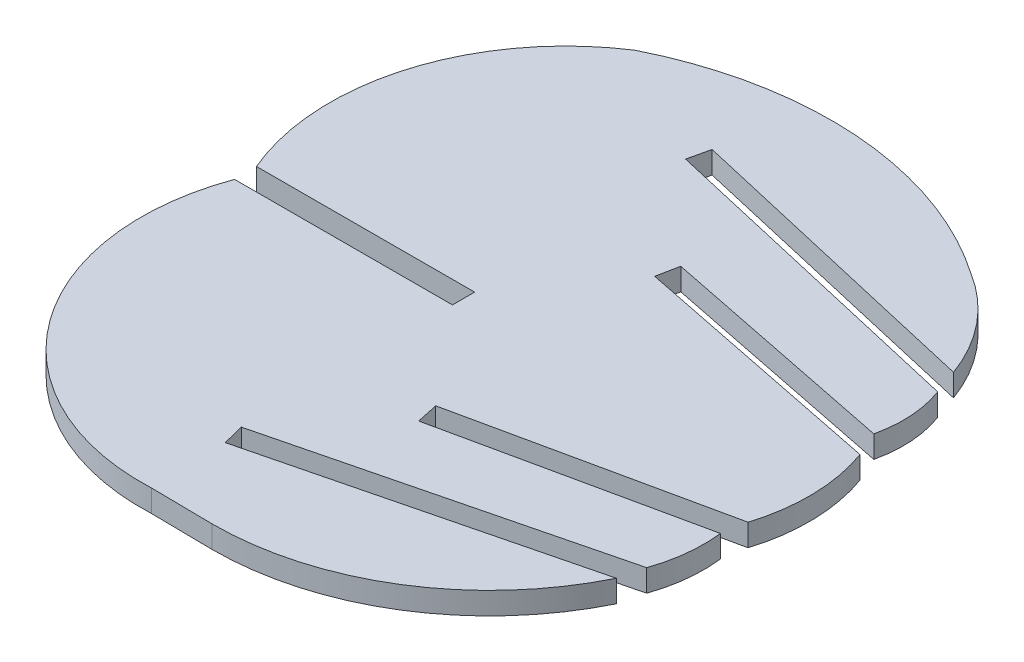
ISO-10303-21;
HEADER;
FILE_DESCRIPTION(('STEP AP214'),'2;1');
FILE_NAME('part.step','',(''),(''),'','','');
FILE_SCHEMA(('AUTOMOTIVE_DESIGN { 1 0 10303 214 1 1 1 1 }'));
ENDSEC;
DATA;
#1=APPLICATION_CONTEXT('core data for automotive mechanical design processes');
#2=APPLICATION_PROTOCOL_DEFINITION('international standard','automotive_design',2000,#1);
#3=PRODUCT_CONTEXT('',#1,'mechanical');
#4=PRODUCT('Part','Part','',(#3));
#5=PRODUCT_RELATED_PRODUCT_CATEGORY('part','',(#4));
#6=PRODUCT_DEFINITION_FORMATION('','',#4);
#7=PRODUCT_DEFINITION_CONTEXT('part definition',#1,'design');
#8=PRODUCT_DEFINITION('design','',#6,#7);
#9=PRODUCT_DEFINITION_SHAPE('','',#8);
#10=(LENGTH_UNIT() NAMED_UNIT(*) SI_UNIT(.MILLI.,.METRE.));
#11=(NAMED_UNIT(*) PLANE_ANGLE_UNIT() SI_UNIT($,.RADIAN.));
#12=(NAMED_UNIT(*) SI_UNIT($,.STERADIAN.) SOLID_ANGLE_UNIT());
#13=UNCERTAINTY_MEASURE_WITH_UNIT(LENGTH_MEASURE(1.E-05),#10,'distance_accuracy_value','');
#14=(GEOMETRIC_REPRESENTATION_CONTEXT(3) GLOBAL_UNCERTAINTY_ASSIGNED_CONTEXT((#13)) GLOBAL_UNIT_ASSIGNED_CONTEXT((#10,
#11,#12)) REPRESENTATION_CONTEXT('',''));
#15=CARTESIAN_POINT('',(0.,0.,0.));
#16=DIRECTION('',(0.,0.,1.));
#17=DIRECTION('',(1.,0.,0.));
#18=AXIS2_PLACEMENT_3D('',#15,#16,#17);
#19=CARTESIAN_POINT('',(-308.132334578698,2.,-455.012990323101));
#20=DIRECTION('',(0.,-1.,0.));
#21=DIRECTION('',(0.,0.,-1.));
#22=AXIS2_PLACEMENT_3D('',#19,#20,#21);
#23=CYLINDRICAL_SURFACE('',#22,32.1187501884);
#24=CARTESIAN_POINT('',(-308.132334578698,0.,-455.012990323101));
#25=DIRECTION('',(0.,1.,0.));
#26=DIRECTION('',(0.,0.,1.));
#27=AXIS2_PLACEMENT_3D('',#24,#25,#26);
#28=CIRCLE('',#27,32.1187501884);
#29=CARTESIAN_POINT('',(-289.859680000044,0.,-481.427460000042));
#30=VERTEX_POINT('',#29);
#31=CARTESIAN_POINT('',(-322.514210000017,0.,-483.731900000011));
#32=VERTEX_POINT('',#31);
#33=EDGE_CURVE('E229',#30,#32,#28,.T.);
#34=ORIENTED_EDGE('',*,*,#33,.T.);
#35=DIRECTION('',(0.,-1.,0.));
#36=VECTOR('',#35,1.);
#37=CARTESIAN_POINT('',(-322.514210000017,2.,-483.731900000011));
#38=LINE('',#37,#36);
#39=CARTESIAN_POINT('',(-322.514210000017,2.,-483.731900000011));
#40=VERTEX_POINT('',#39);
#41=EDGE_CURVE('E11',#40,#32,#38,.T.);
#42=ORIENTED_EDGE('',*,*,#41,.F.);
#43=CARTESIAN_POINT('',(-308.132334578698,2.,-455.012990323101));
#44=DIRECTION('',(0.,1.,0.));
#45=DIRECTION('',(0.,0.,1.));
#46=AXIS2_PLACEMENT_3D('',#43,#44,#45);
#47=CIRCLE('',#46,32.1187501884);
#48=CARTESIAN_POINT('',(-289.859680000044,2.,-481.427460000042));
#49=VERTEX_POINT('',#48);
#50=EDGE_CURVE('E275',#49,#40,#47,.T.);
#51=ORIENTED_EDGE('',*,*,#50,.F.);
#52=DIRECTION('',(0.,-1.,0.));
#53=VECTOR('',#52,1.);
#54=CARTESIAN_POINT('',(-289.859680000044,2.,-481.427460000042));
#55=LINE('',#54,#53);
#56=EDGE_CURVE('E225',#49,#30,#55,.T.);
#57=ORIENTED_EDGE('',*,*,#56,.T.);
#58=EDGE_LOOP('',(#34,#42,#51,#57));
#59=FACE_BOUND('',#58,.T.);
#60=ADVANCED_FACE('F37',(#59),#23,.T.);
#61=CARTESIAN_POINT('',(-310.896038219892,2.,-465.894165835681));
#62=DIRECTION('',(0.,-1.,0.));
#63=DIRECTION('',(0.,0.,-1.));
#64=AXIS2_PLACEMENT_3D('',#61,#62,#63);
#65=CYLINDRICAL_SURFACE('',#64,21.2877118458);
#66=CARTESIAN_POINT('',(-310.896038219892,0.,-465.894165835681));
#67=DIRECTION('',(0.,1.,0.));
#68=DIRECTION('',(0.,0.,1.));
#69=AXIS2_PLACEMENT_3D('',#66,#67,#68);
#70=CIRCLE('',#69,21.2877118458);
#71=CARTESIAN_POINT('',(-330.492059999991,0.,-457.577760000003));
#72=VERTEX_POINT('',#71);
#73=EDGE_CURVE('E232',#32,#72,#70,.T.);
#74=ORIENTED_EDGE('',*,*,#73,.T.);
#75=DIRECTION('',(0.,-1.,0.));
#76=VECTOR('',#75,1.);
#77=CARTESIAN_POINT('',(-330.492059999991,2.,-457.577760000003));
#78=LINE('',#77,#76);
#79=CARTESIAN_POINT('',(-330.492059999991,2.,-457.577760000003));
#80=VERTEX_POINT('',#79);
#81=EDGE_CURVE('E45',#80,#72,#78,.T.);
#82=ORIENTED_EDGE('',*,*,#81,.F.);
#83=CARTESIAN_POINT('',(-310.896038219892,2.,-465.894165835681));
#84=DIRECTION('',(0.,1.,0.));
#85=DIRECTION('',(0.,0.,1.));
#86=AXIS2_PLACEMENT_3D('',#83,#84,#85);
#87=CIRCLE('',#86,21.2877118458);
#88=EDGE_CURVE('E144',#40,#80,#87,.T.);
#89=ORIENTED_EDGE('',*,*,#88,.F.);
#90=ORIENTED_EDGE('',*,*,#41,.T.);
#91=EDGE_LOOP('',(#74,#82,#89,#90));
#92=FACE_BOUND('',#91,.T.);
#93=ADVANCED_FACE('F413',(#92),#65,.T.);
#94=CARTESIAN_POINT('',(-525.732548640906,2.,-457.344503106221));
#95=DIRECTION('',(-0.0011947149330365,0.,-0.99999928632786));
#96=DIRECTION('',(-0.99999928632786,0.,0.0011947149330365));
#97=AXIS2_PLACEMENT_3D('',#94,#95,#96);
#98=PLANE('',#97);
#99=DIRECTION('',(0.99999928632786,0.,-0.0011947149330365));
#100=VECTOR('',#99,1.);
#101=CARTESIAN_POINT('',(-525.732548640906,0.,-457.344503106221));
#102=LINE('',#101,#100);
#103=CARTESIAN_POINT('',(-310.83048,0.,-457.60125));
#104=VERTEX_POINT('',#103);
#105=EDGE_CURVE('E234',#72,#104,#102,.T.);
#106=ORIENTED_EDGE('',*,*,#105,.T.);
#107=DIRECTION('',(0.,-1.,0.));
#108=VECTOR('',#107,1.);
#109=CARTESIAN_POINT('',(-310.83048,2.,-457.60125));
#110=LINE('',#109,#108);
#111=CARTESIAN_POINT('',(-310.83048,2.,-457.60125));
#112=VERTEX_POINT('',#111);
#113=EDGE_CURVE('E330',#112,#104,#110,.T.);
#114=ORIENTED_EDGE('',*,*,#113,.F.);
#115=DIRECTION('',(0.99999928632786,0.,-0.0011947149330365));
#116=VECTOR('',#115,1.);
#117=CARTESIAN_POINT('',(-525.732548640906,2.,-457.344503106221));
#118=LINE('',#117,#116);
#119=EDGE_CURVE('E338',#80,#112,#118,.T.);
#120=ORIENTED_EDGE('',*,*,#119,.F.);
#121=ORIENTED_EDGE('',*,*,#81,.T.);
#122=EDGE_LOOP('',(#106,#114,#120,#121));
#123=FACE_BOUND('',#122,.T.);
#124=ADVANCED_FACE('F336',(#123),#98,.F.);
#125=CARTESIAN_POINT('',(-310.967666188731,2.,-572.401407932951));
#126=DIRECTION('',(0.999999285988265,0.,-0.00119499914676536));
#127=DIRECTION('',(-0.00119499914676536,0.,-0.999999285988265));
#128=AXIS2_PLACEMENT_3D('',#125,#126,#127);
#129=PLANE('',#128);
#130=DIRECTION('',(0.00119499914676536,0.,0.999999285988265));
#131=VECTOR('',#130,1.);
#132=CARTESIAN_POINT('',(-310.967666188731,0.,-572.401407932951));
#133=LINE('',#132,#131);
#134=CARTESIAN_POINT('',(-310.82809,0.,-455.60125));
#135=VERTEX_POINT('',#134);
#136=EDGE_CURVE('E236',#104,#135,#133,.T.);
#137=ORIENTED_EDGE('',*,*,#136,.T.);
#138=DIRECTION('',(0.,-1.,0.));
#139=VECTOR('',#138,1.);
#140=CARTESIAN_POINT('',(-310.82809,2.,-455.60125));
#141=LINE('',#140,#139);
#142=CARTESIAN_POINT('',(-310.82809,2.,-455.60125));
#143=VERTEX_POINT('',#142);
#144=EDGE_CURVE('E327',#143,#135,#141,.T.);
#145=ORIENTED_EDGE('',*,*,#144,.F.);
#146=DIRECTION('',(0.00119499914676536,0.,0.999999285988265));
#147=VECTOR('',#146,1.);
#148=CARTESIAN_POINT('',(-310.967666188731,2.,-572.401407932951));
#149=LINE('',#148,#147);
#150=EDGE_CURVE('E356',#112,#143,#149,.T.);
#151=ORIENTED_EDGE('',*,*,#150,.F.);
#152=ORIENTED_EDGE('',*,*,#113,.T.);
#153=EDGE_LOOP('',(#137,#145,#151,#152));
#154=FACE_BOUND('',#153,.T.);
#155=ADVANCED_FACE('F347',(#154),#129,.F.);
#156=CARTESIAN_POINT('',(-525.730151380826,2.,-455.344488742693));
#157=DIRECTION('',(0.00119478181080637,0.,0.999999286247958));
#158=DIRECTION('',(0.999999286247958,0.,-0.00119478181080637));
#159=AXIS2_PLACEMENT_3D('',#156,#157,#158);
#160=PLANE('',#159);
#161=DIRECTION('',(-0.999999286247958,0.,0.00119478181080637));
#162=VECTOR('',#161,1.);
#163=CARTESIAN_POINT('',(-525.730151380826,0.,-455.344488742693));
#164=LINE('',#163,#162);
#165=CARTESIAN_POINT('',(-330.47183,0.,-455.57778));
#166=VERTEX_POINT('',#165);
#167=EDGE_CURVE('E238',#135,#166,#164,.T.);
#168=ORIENTED_EDGE('',*,*,#167,.T.);
#169=DIRECTION('',(0.,-1.,0.));
#170=VECTOR('',#169,1.);
#171=CARTESIAN_POINT('',(-330.47183,2.,-455.57778));
#172=LINE('',#171,#170);
#173=CARTESIAN_POINT('',(-330.47183,2.,-455.57778));
#174=VERTEX_POINT('',#173);
#175=EDGE_CURVE('E324',#174,#166,#172,.T.);
#176=ORIENTED_EDGE('',*,*,#175,.F.);
#177=DIRECTION('',(-0.999999286247958,0.,0.00119478181080637));
#178=VECTOR('',#177,1.);
#179=CARTESIAN_POINT('',(-525.730151380826,2.,-455.344488742693));
#180=LINE('',#179,#178);
#181=EDGE_CURVE('E353',#143,#174,#180,.T.);
#182=ORIENTED_EDGE('',*,*,#181,.F.);
#183=ORIENTED_EDGE('',*,*,#144,.T.);
#184=EDGE_LOOP('',(#168,#176,#182,#183));
#185=FACE_BOUND('',#184,.T.);
#186=ADVANCED_FACE('F351',(#185),#160,.F.);
#187=CARTESIAN_POINT('',(-311.017530089618,2.,-448.422950122499));
#188=DIRECTION('',(0.,-1.,0.));
#189=DIRECTION('',(0.,0.,-1.));
#190=AXIS2_PLACEMENT_3D('',#187,#188,#189);
#191=CYLINDRICAL_SURFACE('',#190,20.7282747854);
#192=CARTESIAN_POINT('',(-311.017530089618,0.,-448.422950122499));
#193=DIRECTION('',(0.,1.,0.));
#194=DIRECTION('',(0.,0.,1.));
#195=AXIS2_PLACEMENT_3D('',#192,#193,#194);
#196=CIRCLE('',#195,20.7282747854);
#197=CARTESIAN_POINT('',(-310.089059999999,0.,-427.71548000006));
#198=VERTEX_POINT('',#197);
#199=EDGE_CURVE('E240',#166,#198,#196,.T.);
#200=ORIENTED_EDGE('',*,*,#199,.T.);
#201=DIRECTION('',(0.,-1.,0.));
#202=VECTOR('',#201,1.);
#203=CARTESIAN_POINT('',(-310.089059999999,2.,-427.71548000006));
#204=LINE('',#203,#202);
#205=CARTESIAN_POINT('',(-310.089059999999,2.,-427.71548000006));
#206=VERTEX_POINT('',#205);
#207=EDGE_CURVE('E321',#206,#198,#204,.T.);
#208=ORIENTED_EDGE('',*,*,#207,.F.);
#209=CARTESIAN_POINT('',(-311.017530089618,2.,-448.422950122499));
#210=DIRECTION('',(0.,1.,0.));
#211=DIRECTION('',(0.,0.,1.));
#212=AXIS2_PLACEMENT_3D('',#209,#210,#211);
#213=CIRCLE('',#212,20.7282747854);
#214=EDGE_CURVE('E355',#174,#206,#213,.T.);
#215=ORIENTED_EDGE('',*,*,#214,.F.);
#216=ORIENTED_EDGE('',*,*,#175,.T.);
#217=EDGE_LOOP('',(#200,#208,#215,#216));
#218=FACE_BOUND('',#217,.T.);
#219=ADVANCED_FACE('F426',(#218),#191,.T.);
#220=CARTESIAN_POINT('',(-527.776948437322,2.,-430.649752368045));
#221=DIRECTION('',(0.0134780389510931,0.,-0.999909167107709));
#222=DIRECTION('',(-0.999909167107709,0.,-0.0134780389510931));
#223=AXIS2_PLACEMENT_3D('',#220,#221,#222);
#224=PLANE('',#223);
#225=DIRECTION('',(0.999909167107709,0.,0.0134780389510931));
#226=VECTOR('',#225,1.);
#227=CARTESIAN_POINT('',(-527.776948437322,0.,-430.649752368045));
#228=LINE('',#227,#226);
#229=CARTESIAN_POINT('',(-304.58505,0.,-427.64129));
#230=VERTEX_POINT('',#229);
#231=EDGE_CURVE('E242',#198,#230,#228,.T.);
#232=ORIENTED_EDGE('',*,*,#231,.T.);
#233=DIRECTION('',(0.,-1.,0.));
#234=VECTOR('',#233,1.);
#235=CARTESIAN_POINT('',(-304.58505,2.,-427.64129));
#236=LINE('',#235,#234);
#237=CARTESIAN_POINT('',(-304.58505,2.,-427.64129));
#238=VERTEX_POINT('',#237);
#239=EDGE_CURVE('E318',#238,#230,#236,.T.);
#240=ORIENTED_EDGE('',*,*,#239,.F.);
#241=DIRECTION('',(0.999909167107709,0.,0.0134780389510931));
#242=VECTOR('',#241,1.);
#243=CARTESIAN_POINT('',(-527.776948437322,2.,-430.649752368045));
#244=LINE('',#243,#242);
#245=EDGE_CURVE('E358',#206,#238,#244,.T.);
#246=ORIENTED_EDGE('',*,*,#245,.F.);
#247=ORIENTED_EDGE('',*,*,#207,.T.);
#248=EDGE_LOOP('',(#232,#240,#246,#247));
#249=FACE_BOUND('',#248,.T.);
#250=ADVANCED_FACE('F429',(#249),#224,.F.);
#251=CARTESIAN_POINT('',(-304.514602881381,2.,-452.628368208738));
#252=DIRECTION('',(0.,-1.,0.));
#253=DIRECTION('',(0.,0.,-1.));
#254=AXIS2_PLACEMENT_3D('',#251,#252,#253);
#255=CYLINDRICAL_SURFACE('',#254,24.9871775158);
#256=CARTESIAN_POINT('',(-304.514602881381,0.,-452.628368208738));
#257=DIRECTION('',(0.,1.,0.));
#258=DIRECTION('',(0.,0.,1.));
#259=AXIS2_PLACEMENT_3D('',#256,#257,#258);
#260=CIRCLE('',#259,24.9871775158);
#261=CARTESIAN_POINT('',(-282.075839999958,0.,-441.634689999997));
#262=VERTEX_POINT('',#261);
#263=EDGE_CURVE('E244',#230,#262,#260,.T.);
#264=ORIENTED_EDGE('',*,*,#263,.T.);
#265=DIRECTION('',(0.,-1.,0.));
#266=VECTOR('',#265,1.);
#267=CARTESIAN_POINT('',(-282.075839999958,2.,-441.634689999997));
#268=LINE('',#267,#266);
#269=CARTESIAN_POINT('',(-282.075839999958,2.,-441.634689999997));
#270=VERTEX_POINT('',#269);
#271=EDGE_CURVE('E315',#270,#262,#268,.T.);
#272=ORIENTED_EDGE('',*,*,#271,.F.);
#273=CARTESIAN_POINT('',(-304.514602881381,2.,-452.628368208738));
#274=DIRECTION('',(0.,1.,0.));
#275=DIRECTION('',(0.,0.,1.));
#276=AXIS2_PLACEMENT_3D('',#273,#274,#275);
#277=CIRCLE('',#276,24.9871775158);
#278=EDGE_CURVE('E364',#238,#270,#277,.T.);
#279=ORIENTED_EDGE('',*,*,#278,.F.);
#280=ORIENTED_EDGE('',*,*,#239,.T.);
#281=EDGE_LOOP('',(#264,#272,#279,#280));
#282=FACE_BOUND('',#281,.T.);
#283=ADVANCED_FACE('F433',(#282),#255,.T.);
#284=CARTESIAN_POINT('',(-480.914033449512,2.,-392.010956386441));
#285=DIRECTION('',(0.242141499259378,0.,0.970240946536694));
#286=DIRECTION('',(0.970240946536694,0.,-0.242141499259378));
#287=AXIS2_PLACEMENT_3D('',#284,#285,#286);
#288=PLANE('',#287);
#289=DIRECTION('',(-0.970240946536694,0.,0.242141499259378));
#290=VECTOR('',#289,1.);
#291=CARTESIAN_POINT('',(-480.914033449512,0.,-392.010956386441));
#292=LINE('',#291,#290);
#293=CARTESIAN_POINT('',(-310.32084,0.,-434.58563));
#294=VERTEX_POINT('',#293);
#295=EDGE_CURVE('E246',#262,#294,#292,.T.);
#296=ORIENTED_EDGE('',*,*,#295,.T.);
#297=DIRECTION('',(0.,-1.,0.));
#298=VECTOR('',#297,1.);
#299=CARTESIAN_POINT('',(-310.32084,2.,-434.58563));
#300=LINE('',#299,#298);
#301=CARTESIAN_POINT('',(-310.32084,2.,-434.58563));
#302=VERTEX_POINT('',#301);
#303=EDGE_CURVE('E312',#302,#294,#300,.T.);
#304=ORIENTED_EDGE('',*,*,#303,.F.);
#305=DIRECTION('',(-0.970240946536694,0.,0.242141499259378));
#306=VECTOR('',#305,1.);
#307=CARTESIAN_POINT('',(-480.914033449512,2.,-392.010956386441));
#308=LINE('',#307,#306);
#309=EDGE_CURVE('E366',#270,#302,#308,.T.);
#310=ORIENTED_EDGE('',*,*,#309,.F.);
#311=ORIENTED_EDGE('',*,*,#271,.T.);
#312=EDGE_LOOP('',(#296,#304,#310,#311));
#313=FACE_BOUND('',#312,.T.);
#314=ADVANCED_FACE('F437',(#313),#288,.F.);
#315=CARTESIAN_POINT('',(-355.276235761943,2.,-614.719119650896));
#316=DIRECTION('',(-0.970241243267926,0.,0.242140310278791));
#317=DIRECTION('',(0.242140310278791,0.,0.970241243267926));
#318=AXIS2_PLACEMENT_3D('',#315,#316,#317);
#319=PLANE('',#318);
#320=DIRECTION('',(-0.242140310278791,0.,-0.970241243267926));
#321=VECTOR('',#320,1.);
#322=CARTESIAN_POINT('',(-355.276235761943,0.,-614.719119650896));
#323=LINE('',#322,#321);
#324=CARTESIAN_POINT('',(-310.80512,0.,-436.52611));
#325=VERTEX_POINT('',#324);
#326=EDGE_CURVE('E248',#294,#325,#323,.T.);
#327=ORIENTED_EDGE('',*,*,#326,.T.);
#328=DIRECTION('',(0.,-1.,0.));
#329=VECTOR('',#328,1.);
#330=CARTESIAN_POINT('',(-310.80512,2.,-436.52611));
#331=LINE('',#330,#329);
#332=CARTESIAN_POINT('',(-310.80512,2.,-436.52611));
#333=VERTEX_POINT('',#332);
#334=EDGE_CURVE('E309',#333,#325,#331,.T.);
#335=ORIENTED_EDGE('',*,*,#334,.F.);
#336=DIRECTION('',(-0.242140310278791,0.,-0.970241243267926));
#337=VECTOR('',#336,1.);
#338=CARTESIAN_POINT('',(-355.276235761943,2.,-614.719119650896));
#339=LINE('',#338,#337);
#340=EDGE_CURVE('E368',#302,#333,#339,.T.);
#341=ORIENTED_EDGE('',*,*,#340,.F.);
#342=ORIENTED_EDGE('',*,*,#303,.T.);
#343=EDGE_LOOP('',(#327,#335,#341,#342));
#344=FACE_BOUND('',#343,.T.);
#345=ADVANCED_FACE('F441',(#344),#319,.F.);
#346=CARTESIAN_POINT('',(-481.398306544915,2.,-393.951430489975));
#347=DIRECTION('',(-0.242141540054788,0.,-0.970240936355448));
#348=DIRECTION('',(-0.970240936355448,0.,0.242141540054788));
#349=AXIS2_PLACEMENT_3D('',#346,#347,#348);
#350=PLANE('',#349);
#351=DIRECTION('',(0.970240936355448,0.,-0.242141540054788));
#352=VECTOR('',#351,1.);
#353=CARTESIAN_POINT('',(-481.398306544915,0.,-393.951430489975));
#354=LINE('',#353,#352);
#355=CARTESIAN_POINT('',(-281.53179,0.,-443.83181));
#356=VERTEX_POINT('',#355);
#357=EDGE_CURVE('E250',#325,#356,#354,.T.);
#358=ORIENTED_EDGE('',*,*,#357,.T.);
#359=DIRECTION('',(0.,-1.,0.));
#360=VECTOR('',#359,1.);
#361=CARTESIAN_POINT('',(-281.53179,2.,-443.83181));
#362=LINE('',#361,#360);
#363=CARTESIAN_POINT('',(-281.53179,2.,-443.83181));
#364=VERTEX_POINT('',#363);
#365=EDGE_CURVE('E306',#364,#356,#362,.T.);
#366=ORIENTED_EDGE('',*,*,#365,.F.);
#367=DIRECTION('',(0.970240936355448,0.,-0.242141540054788));
#368=VECTOR('',#367,1.);
#369=CARTESIAN_POINT('',(-481.398306544915,2.,-393.951430489975));
#370=LINE('',#369,#368);
#371=EDGE_CURVE('E370',#333,#364,#370,.T.);
#372=ORIENTED_EDGE('',*,*,#371,.F.);
#373=ORIENTED_EDGE('',*,*,#334,.T.);
#374=EDGE_LOOP('',(#358,#366,#372,#373));
#375=FACE_BOUND('',#374,.T.);
#376=ADVANCED_FACE('F445',(#375),#350,.F.);
#377=CARTESIAN_POINT('',(-294.223939964185,2.,-448.25279032817));
#378=DIRECTION('',(0.,-1.,0.));
#379=DIRECTION('',(0.,0.,-1.));
#380=AXIS2_PLACEMENT_3D('',#377,#378,#379);
#381=CYLINDRICAL_SURFACE('',#380,13.4400795301001);
#382=CARTESIAN_POINT('',(-294.223939964185,0.,-448.25279032817));
#383=DIRECTION('',(0.,1.,0.));
#384=DIRECTION('',(0.,0.,1.));
#385=AXIS2_PLACEMENT_3D('',#382,#383,#384);
#386=CIRCLE('',#385,13.4400795301001);
#387=CARTESIAN_POINT('',(-280.877010000046,0.,-449.832410000048));
#388=VERTEX_POINT('',#387);
#389=EDGE_CURVE('E252',#356,#388,#386,.T.);
#390=ORIENTED_EDGE('',*,*,#389,.T.);
#391=DIRECTION('',(0.,-1.,0.));
#392=VECTOR('',#391,1.);
#393=CARTESIAN_POINT('',(-280.877010000046,2.,-449.832410000048));
#394=LINE('',#393,#392);
#395=CARTESIAN_POINT('',(-280.877010000046,2.,-449.832410000048));
#396=VERTEX_POINT('',#395);
#397=EDGE_CURVE('E303',#396,#388,#394,.T.);
#398=ORIENTED_EDGE('',*,*,#397,.F.);
#399=CARTESIAN_POINT('',(-294.223939964185,2.,-448.25279032817));
#400=DIRECTION('',(0.,1.,0.));
#401=DIRECTION('',(0.,0.,1.));
#402=AXIS2_PLACEMENT_3D('',#399,#400,#401);
#403=CIRCLE('',#402,13.4400795301001);
#404=EDGE_CURVE('E372',#364,#396,#403,.T.);
#405=ORIENTED_EDGE('',*,*,#404,.F.);
#406=ORIENTED_EDGE('',*,*,#365,.T.);
#407=EDGE_LOOP('',(#390,#398,#405,#406));
#408=FACE_BOUND('',#407,.T.);
#409=ADVANCED_FACE('F449',(#408),#381,.T.);
#410=CARTESIAN_POINT('',(-489.797810597508,2.,-404.79888020814));
#411=DIRECTION('',(0.210713489082991,0.,0.977547863543506));
#412=DIRECTION('',(0.977547863543506,0.,-0.210713489082991));
#413=AXIS2_PLACEMENT_3D('',#410,#411,#412);
#414=PLANE('',#413);
#415=DIRECTION('',(-0.977547863543506,0.,0.210713489082991));
#416=VECTOR('',#415,1.);
#417=CARTESIAN_POINT('',(-489.797810597508,0.,-404.79888020814));
#418=LINE('',#417,#416);
#419=CARTESIAN_POINT('',(-303.27715,0.,-445.00399));
#420=VERTEX_POINT('',#419);
#421=EDGE_CURVE('E254',#388,#420,#418,.T.);
#422=ORIENTED_EDGE('',*,*,#421,.T.);
#423=DIRECTION('',(0.,-1.,0.));
#424=VECTOR('',#423,1.);
#425=CARTESIAN_POINT('',(-303.27715,2.,-445.00399));
#426=LINE('',#425,#424);
#427=CARTESIAN_POINT('',(-303.27715,2.,-445.00399));
#428=VERTEX_POINT('',#427);
#429=EDGE_CURVE('E300',#428,#420,#426,.T.);
#430=ORIENTED_EDGE('',*,*,#429,.F.);
#431=DIRECTION('',(-0.977547863543506,0.,0.210713489082991));
#432=VECTOR('',#431,1.);
#433=CARTESIAN_POINT('',(-489.797810597508,2.,-404.79888020814));
#434=LINE('',#433,#432);
#435=EDGE_CURVE('E374',#396,#428,#434,.T.);
#436=ORIENTED_EDGE('',*,*,#435,.F.);
#437=ORIENTED_EDGE('',*,*,#397,.T.);
#438=EDGE_LOOP('',(#422,#430,#436,#437));
#439=FACE_BOUND('',#438,.T.);
#440=ADVANCED_FACE('F453',(#439),#414,.F.);
#441=CARTESIAN_POINT('',(-339.348240196323,2.,-612.349128918015));
#442=DIRECTION('',(-0.97754867708427,0.,0.21070971484674));
#443=DIRECTION('',(0.21070971484674,0.,0.97754867708427));
#444=AXIS2_PLACEMENT_3D('',#441,#442,#443);
#445=PLANE('',#444);
#446=DIRECTION('',(-0.21070971484674,0.,-0.97754867708427));
#447=VECTOR('',#446,1.);
#448=CARTESIAN_POINT('',(-339.348240196323,0.,-612.349128918015));
#449=LINE('',#448,#447);
#450=CARTESIAN_POINT('',(-303.69857,0.,-446.95909));
#451=VERTEX_POINT('',#450);
#452=EDGE_CURVE('E256',#420,#451,#449,.T.);
#453=ORIENTED_EDGE('',*,*,#452,.T.);
#454=DIRECTION('',(0.,-1.,0.));
#455=VECTOR('',#454,1.);
#456=CARTESIAN_POINT('',(-303.69857,2.,-446.95909));
#457=LINE('',#456,#455);
#458=CARTESIAN_POINT('',(-303.69857,2.,-446.95909));
#459=VERTEX_POINT('',#458);
#460=EDGE_CURVE('E297',#459,#451,#457,.T.);
#461=ORIENTED_EDGE('',*,*,#460,.F.);
#462=DIRECTION('',(-0.21070971484674,0.,-0.97754867708427));
#463=VECTOR('',#462,1.);
#464=CARTESIAN_POINT('',(-339.348240196323,2.,-612.349128918015));
#465=LINE('',#464,#463);
#466=EDGE_CURVE('E376',#428,#459,#465,.T.);
#467=ORIENTED_EDGE('',*,*,#466,.F.);
#468=ORIENTED_EDGE('',*,*,#429,.T.);
#469=EDGE_LOOP('',(#453,#461,#467,#468));
#470=FACE_BOUND('',#469,.T.);
#471=ADVANCED_FACE('F457',(#470),#445,.F.);
#472=CARTESIAN_POINT('',(-490.219209272516,2.,-406.753957393124));
#473=DIRECTION('',(-0.21071362636793,0.,-0.977547833951299));
#474=DIRECTION('',(-0.977547833951299,0.,0.21071362636793));
#475=AXIS2_PLACEMENT_3D('',#472,#473,#474);
#476=PLANE('',#475);
#477=DIRECTION('',(0.977547833951299,0.,-0.21071362636793));
#478=VECTOR('',#477,1.);
#479=CARTESIAN_POINT('',(-490.219209272516,0.,-406.753957393124));
#480=LINE('',#479,#478);
#481=CARTESIAN_POINT('',(-280.51154,0.,-451.95713));
#482=VERTEX_POINT('',#481);
#483=EDGE_CURVE('E258',#451,#482,#480,.T.);
#484=ORIENTED_EDGE('',*,*,#483,.T.);
#485=DIRECTION('',(0.,-1.,0.));
#486=VECTOR('',#485,1.);
#487=CARTESIAN_POINT('',(-280.51154,2.,-451.95713));
#488=LINE('',#487,#486);
#489=CARTESIAN_POINT('',(-280.51154,2.,-451.95713));
#490=VERTEX_POINT('',#489);
#491=EDGE_CURVE('E294',#490,#482,#488,.T.);
#492=ORIENTED_EDGE('',*,*,#491,.F.);
#493=DIRECTION('',(0.977547833951299,0.,-0.21071362636793));
#494=VECTOR('',#493,1.);
#495=CARTESIAN_POINT('',(-490.219209272516,2.,-406.753957393124));
#496=LINE('',#495,#494);
#497=EDGE_CURVE('E378',#459,#490,#496,.T.);
#498=ORIENTED_EDGE('',*,*,#497,.F.);
#499=ORIENTED_EDGE('',*,*,#460,.T.);
#500=EDGE_LOOP('',(#484,#492,#498,#499));
#501=FACE_BOUND('',#500,.T.);
#502=ADVANCED_FACE('F461',(#501),#476,.F.);
#503=CARTESIAN_POINT('',(-296.069260044101,2.,-456.771891919404));
#504=DIRECTION('',(0.,-1.,0.));
#505=DIRECTION('',(0.,0.,-1.));
#506=AXIS2_PLACEMENT_3D('',#503,#504,#505);
#507=CYLINDRICAL_SURFACE('',#506,16.2857172182);
#508=CARTESIAN_POINT('',(-296.069260044101,0.,-456.771891919404));
#509=DIRECTION('',(0.,1.,0.));
#510=DIRECTION('',(0.,0.,1.));
#511=AXIS2_PLACEMENT_3D('',#508,#509,#510);
#512=CIRCLE('',#511,16.2857172182);
#513=CARTESIAN_POINT('',(-280.749129999982,0.,-462.296220000033));
#514=VERTEX_POINT('',#513);
#515=EDGE_CURVE('E260',#482,#514,#512,.T.);
#516=ORIENTED_EDGE('',*,*,#515,.T.);
#517=DIRECTION('',(0.,-1.,0.));
#518=VECTOR('',#517,1.);
#519=CARTESIAN_POINT('',(-280.749129999982,2.,-462.296220000033));
#520=LINE('',#519,#518);
#521=CARTESIAN_POINT('',(-280.749129999982,2.,-462.296220000033));
#522=VERTEX_POINT('',#521);
#523=EDGE_CURVE('E291',#522,#514,#520,.T.);
#524=ORIENTED_EDGE('',*,*,#523,.F.);
#525=CARTESIAN_POINT('',(-296.069260044101,2.,-456.771891919404));
#526=DIRECTION('',(0.,1.,0.));
#527=DIRECTION('',(0.,0.,1.));
#528=AXIS2_PLACEMENT_3D('',#525,#526,#527);
#529=CIRCLE('',#528,16.2857172182);
#530=EDGE_CURVE('E380',#490,#522,#529,.T.);
#531=ORIENTED_EDGE('',*,*,#530,.F.);
#532=ORIENTED_EDGE('',*,*,#491,.T.);
#533=EDGE_LOOP('',(#516,#524,#531,#532));
#534=FACE_BOUND('',#533,.T.);
#535=ADVANCED_FACE('F465',(#534),#507,.T.);
#536=CARTESIAN_POINT('',(-537.574418620287,2.,-513.964729422169));
#537=DIRECTION('',(-0.197229797383015,0.,0.980357285393573));
#538=DIRECTION('',(0.980357285393573,0.,0.197229797383015));
#539=AXIS2_PLACEMENT_3D('',#536,#537,#538);
#540=PLANE('',#539);
#541=DIRECTION('',(-0.980357285393573,0.,-0.197229797383015));
#542=VECTOR('',#541,1.);
#543=CARTESIAN_POINT('',(-537.574418620287,0.,-513.964729422169));
#544=LINE('',#543,#542);
#545=CARTESIAN_POINT('',(-303.94241,0.,-466.96228));
#546=VERTEX_POINT('',#545);
#547=EDGE_CURVE('E262',#514,#546,#544,.T.);
#548=ORIENTED_EDGE('',*,*,#547,.T.);
#549=DIRECTION('',(0.,-1.,0.));
#550=VECTOR('',#549,1.);
#551=CARTESIAN_POINT('',(-303.94241,2.,-466.96228));
#552=LINE('',#551,#550);
#553=CARTESIAN_POINT('',(-303.94241,2.,-466.96228));
#554=VERTEX_POINT('',#553);
#555=EDGE_CURVE('E288',#554,#546,#552,.T.);
#556=ORIENTED_EDGE('',*,*,#555,.F.);
#557=DIRECTION('',(-0.980357285393573,0.,-0.197229797383015));
#558=VECTOR('',#557,1.);
#559=CARTESIAN_POINT('',(-537.574418620287,2.,-513.964729422169));
#560=LINE('',#559,#558);
#561=EDGE_CURVE('E382',#522,#554,#560,.T.);
#562=ORIENTED_EDGE('',*,*,#561,.F.);
#563=ORIENTED_EDGE('',*,*,#523,.T.);
#564=EDGE_LOOP('',(#548,#556,#562,#563));
#565=FACE_BOUND('',#564,.T.);
#566=ADVANCED_FACE('F469',(#565),#540,.F.);
#567=CARTESIAN_POINT('',(-292.237686250215,2.,-525.141991259551));
#568=DIRECTION('',(-0.980357157315064,0.,-0.197230434013434));
#569=DIRECTION('',(-0.197230434013434,0.,0.980357157315064));
#570=AXIS2_PLACEMENT_3D('',#567,#568,#569);
#571=PLANE('',#570);
#572=DIRECTION('',(0.197230434013434,0.,-0.980357157315064));
#573=VECTOR('',#572,1.);
#574=CARTESIAN_POINT('',(-292.237686250215,0.,-525.141991259551));
#575=LINE('',#574,#573);
#576=CARTESIAN_POINT('',(-303.54795,0.,-468.92299));
#577=VERTEX_POINT('',#576);
#578=EDGE_CURVE('E264',#546,#577,#575,.T.);
#579=ORIENTED_EDGE('',*,*,#578,.T.);
#580=DIRECTION('',(0.,-1.,0.));
#581=VECTOR('',#580,1.);
#582=CARTESIAN_POINT('',(-303.54795,2.,-468.92299));
#583=LINE('',#582,#581);
#584=CARTESIAN_POINT('',(-303.54795,2.,-468.92299));
#585=VERTEX_POINT('',#584);
#586=EDGE_CURVE('E285',#585,#577,#583,.T.);
#587=ORIENTED_EDGE('',*,*,#586,.F.);
#588=DIRECTION('',(0.197230434013434,0.,-0.980357157315064));
#589=VECTOR('',#588,1.);
#590=CARTESIAN_POINT('',(-292.237686250215,2.,-525.141991259551));
#591=LINE('',#590,#589);
#592=EDGE_CURVE('E384',#554,#585,#591,.T.);
#593=ORIENTED_EDGE('',*,*,#592,.F.);
#594=ORIENTED_EDGE('',*,*,#555,.T.);
#595=EDGE_LOOP('',(#579,#587,#593,#594));
#596=FACE_BOUND('',#595,.T.);
#597=ADVANCED_FACE('F473',(#596),#571,.F.);
#598=CARTESIAN_POINT('',(-537.179960996091,2.,-515.92546897954));
#599=DIRECTION('',(0.197229914658241,0.,-0.980357261799954));
#600=DIRECTION('',(-0.980357261799954,0.,-0.197229914658241));
#601=AXIS2_PLACEMENT_3D('',#598,#599,#600);
#602=PLANE('',#601);
#603=DIRECTION('',(0.980357261799954,0.,0.197229914658241));
#604=VECTOR('',#603,1.);
#605=CARTESIAN_POINT('',(-537.179960996091,0.,-515.92546897954));
#606=LINE('',#605,#604);
#607=CARTESIAN_POINT('',(-281.74159,0.,-464.53595));
#608=VERTEX_POINT('',#607);
#609=EDGE_CURVE('E266',#577,#608,#606,.T.);
#610=ORIENTED_EDGE('',*,*,#609,.T.);
#611=DIRECTION('',(0.,-1.,0.));
#612=VECTOR('',#611,1.);
#613=CARTESIAN_POINT('',(-281.74159,2.,-464.53595));
#614=LINE('',#613,#612);
#615=CARTESIAN_POINT('',(-281.74159,2.,-464.53595));
#616=VERTEX_POINT('',#615);
#617=EDGE_CURVE('E282',#616,#608,#614,.T.);
#618=ORIENTED_EDGE('',*,*,#617,.F.);
#619=DIRECTION('',(0.980357261799954,0.,0.197229914658241));
#620=VECTOR('',#619,1.);
#621=CARTESIAN_POINT('',(-537.179960996091,2.,-515.92546897954));
#622=LINE('',#621,#620);
#623=EDGE_CURVE('E386',#585,#616,#622,.T.);
#624=ORIENTED_EDGE('',*,*,#623,.F.);
#625=ORIENTED_EDGE('',*,*,#586,.T.);
#626=EDGE_LOOP('',(#610,#618,#624,#625));
#627=FACE_BOUND('',#626,.T.);
#628=ADVANCED_FACE('F477',(#627),#602,.F.);
#629=CARTESIAN_POINT('',(-292.252250177226,2.,-466.944942707969));
#630=DIRECTION('',(0.,-1.,0.));
#631=DIRECTION('',(0.,0.,-1.));
#632=AXIS2_PLACEMENT_3D('',#629,#630,#631);
#633=CYLINDRICAL_SURFACE('',#632,10.7831916995);
#634=CARTESIAN_POINT('',(-292.252250177226,0.,-466.944942707969));
#635=DIRECTION('',(0.,1.,0.));
#636=DIRECTION('',(0.,0.,1.));
#637=AXIS2_PLACEMENT_3D('',#634,#635,#636);
#638=CIRCLE('',#637,10.7831916995);
#639=CARTESIAN_POINT('',(-282.145279999963,0.,-470.703449999979));
#640=VERTEX_POINT('',#639);
#641=EDGE_CURVE('E268',#608,#640,#638,.T.);
#642=ORIENTED_EDGE('',*,*,#641,.T.);
#643=DIRECTION('',(0.,-1.,0.));
#644=VECTOR('',#643,1.);
#645=CARTESIAN_POINT('',(-282.145279999963,2.,-470.703449999979));
#646=LINE('',#645,#644);
#647=CARTESIAN_POINT('',(-282.145279999963,2.,-470.703449999979));
#648=VERTEX_POINT('',#647);
#649=EDGE_CURVE('E279',#648,#640,#646,.T.);
#650=ORIENTED_EDGE('',*,*,#649,.F.);
#651=CARTESIAN_POINT('',(-292.252250177226,2.,-466.944942707969));
#652=DIRECTION('',(0.,1.,0.));
#653=DIRECTION('',(0.,0.,1.));
#654=AXIS2_PLACEMENT_3D('',#651,#652,#653);
#655=CIRCLE('',#654,10.7831916995);
#656=EDGE_CURVE('E388',#616,#648,#655,.T.);
#657=ORIENTED_EDGE('',*,*,#656,.F.);
#658=ORIENTED_EDGE('',*,*,#617,.T.);
#659=EDGE_LOOP('',(#642,#650,#657,#658));
#660=FACE_BOUND('',#659,.T.);
#661=ADVANCED_FACE('F394',(#660),#633,.T.);
#662=CARTESIAN_POINT('',(-535.777839924752,2.,-529.140913950361));
#663=DIRECTION('',(-0.224519785914057,0.,0.974469530428277));
#664=DIRECTION('',(0.974469530428277,0.,0.224519785914057));
#665=AXIS2_PLACEMENT_3D('',#662,#663,#664);
#666=PLANE('',#665);
#667=DIRECTION('',(-0.974469530428277,0.,-0.224519785914057));
#668=VECTOR('',#667,1.);
#669=CARTESIAN_POINT('',(-535.777839924752,0.,-529.140913950361));
#670=LINE('',#669,#668);
#671=CARTESIAN_POINT('',(-311.71012,0.,-477.51525));
#672=VERTEX_POINT('',#671);
#673=EDGE_CURVE('E270',#640,#672,#670,.T.);
#674=ORIENTED_EDGE('',*,*,#673,.T.);
#675=DIRECTION('',(0.,-1.,0.));
#676=VECTOR('',#675,1.);
#677=CARTESIAN_POINT('',(-311.71012,2.,-477.51525));
#678=LINE('',#677,#676);
#679=CARTESIAN_POINT('',(-311.71012,2.,-477.51525));
#680=VERTEX_POINT('',#679);
#681=EDGE_CURVE('E220',#680,#672,#678,.T.);
#682=ORIENTED_EDGE('',*,*,#681,.F.);
#683=DIRECTION('',(-0.974469530428277,0.,-0.224519785914057));
#684=VECTOR('',#683,1.);
#685=CARTESIAN_POINT('',(-535.777839924752,2.,-529.140913950361));
#686=LINE('',#685,#684);
#687=EDGE_CURVE('E211',#648,#680,#686,.T.);
#688=ORIENTED_EDGE('',*,*,#687,.F.);
#689=ORIENTED_EDGE('',*,*,#649,.T.);
#690=EDGE_LOOP('',(#674,#682,#688,#689));
#691=FACE_BOUND('',#690,.T.);
#692=ADVANCED_FACE('F398',(#691),#666,.F.);
#693=CARTESIAN_POINT('',(-301.801983093831,2.,-520.518911905192));
#694=DIRECTION('',(-0.974469507259616,0.,-0.224519886471559));
#695=DIRECTION('',(-0.224519886471559,0.,0.974469507259616));
#696=AXIS2_PLACEMENT_3D('',#693,#694,#695);
#697=PLANE('',#696);
#698=DIRECTION('',(0.224519886471559,0.,-0.974469507259616));
#699=VECTOR('',#698,1.);
#700=CARTESIAN_POINT('',(-301.801983093831,0.,-520.518911905192));
#701=LINE('',#700,#699);
#702=CARTESIAN_POINT('',(-311.26108,0.,-479.46419));
#703=VERTEX_POINT('',#702);
#704=EDGE_CURVE('E219',#672,#703,#701,.T.);
#705=ORIENTED_EDGE('',*,*,#704,.T.);
#706=DIRECTION('',(0.,-1.,0.));
#707=VECTOR('',#706,1.);
#708=CARTESIAN_POINT('',(-311.26108,2.,-479.46419));
#709=LINE('',#708,#707);
#710=CARTESIAN_POINT('',(-311.26108,2.,-479.46419));
#711=VERTEX_POINT('',#710);
#712=EDGE_CURVE('E216',#711,#703,#709,.T.);
#713=ORIENTED_EDGE('',*,*,#712,.F.);
#714=DIRECTION('',(0.224519886471559,0.,-0.974469507259616));
#715=VECTOR('',#714,1.);
#716=CARTESIAN_POINT('',(-301.801983093831,2.,-520.518911905192));
#717=LINE('',#716,#715);
#718=EDGE_CURVE('E205',#680,#711,#717,.T.);
#719=ORIENTED_EDGE('',*,*,#718,.F.);
#720=ORIENTED_EDGE('',*,*,#681,.T.);
#721=EDGE_LOOP('',(#705,#713,#719,#720));
#722=FACE_BOUND('',#721,.T.);
#723=ADVANCED_FACE('F217',(#722),#697,.F.);
#724=CARTESIAN_POINT('',(-535.328798367618,2.,-531.089892838805));
#725=DIRECTION('',(0.224519947995867,0.,-0.97446949308428));
#726=DIRECTION('',(-0.97446949308428,0.,-0.224519947995867));
#727=AXIS2_PLACEMENT_3D('',#724,#725,#726);
#728=PLANE('',#727);
#729=DIRECTION('',(0.97446949308428,0.,0.224519947995867));
#730=VECTOR('',#729,1.);
#731=CARTESIAN_POINT('',(-535.328798367618,0.,-531.089892838805));
#732=LINE('',#731,#730);
#733=CARTESIAN_POINT('',(-282.95441,0.,-472.94227));
#734=VERTEX_POINT('',#733);
#735=EDGE_CURVE('E130',#703,#734,#732,.T.);
#736=ORIENTED_EDGE('',*,*,#735,.T.);
#737=DIRECTION('',(0.,-1.,0.));
#738=VECTOR('',#737,1.);
#739=CARTESIAN_POINT('',(-282.95441,2.,-472.94227));
#740=LINE('',#739,#738);
#741=CARTESIAN_POINT('',(-282.95441,2.,-472.94227));
#742=VERTEX_POINT('',#741);
#743=EDGE_CURVE('E221',#742,#734,#740,.T.);
#744=ORIENTED_EDGE('',*,*,#743,.F.);
#745=DIRECTION('',(0.97446949308428,0.,0.224519947995867));
#746=VECTOR('',#745,1.);
#747=CARTESIAN_POINT('',(-535.328798367618,2.,-531.089892838805));
#748=LINE('',#747,#746);
#749=EDGE_CURVE('E209',#711,#742,#748,.T.);
#750=ORIENTED_EDGE('',*,*,#749,.F.);
#751=ORIENTED_EDGE('',*,*,#712,.T.);
#752=EDGE_LOOP('',(#736,#744,#750,#751));
#753=FACE_BOUND('',#752,.T.);
#754=ADVANCED_FACE('F223',(#753),#728,.F.);
#755=CARTESIAN_POINT('',(-298.604528653975,2.,-467.258520633985));
#756=DIRECTION('',(0.,-1.,0.));
#757=DIRECTION('',(0.,0.,-1.));
#758=AXIS2_PLACEMENT_3D('',#755,#756,#757);
#759=CYLINDRICAL_SURFACE('',#758,16.650261882);
#760=CARTESIAN_POINT('',(-298.604528653975,0.,-467.258520633985));
#761=DIRECTION('',(0.,1.,0.));
#762=DIRECTION('',(0.,0.,1.));
#763=AXIS2_PLACEMENT_3D('',#760,#761,#762);
#764=CIRCLE('',#763,16.650261882);
#765=EDGE_CURVE('E136',#734,#30,#764,.T.);
#766=ORIENTED_EDGE('',*,*,#765,.T.);
#767=ORIENTED_EDGE('',*,*,#56,.F.);
#768=CARTESIAN_POINT('',(-298.604528653975,2.,-467.258520633985));
#769=DIRECTION('',(0.,1.,0.));
#770=DIRECTION('',(0.,0.,1.));
#771=AXIS2_PLACEMENT_3D('',#768,#769,#770);
#772=CIRCLE('',#771,16.650261882);
#773=EDGE_CURVE('E53',#742,#49,#772,.T.);
#774=ORIENTED_EDGE('',*,*,#773,.F.);
#775=ORIENTED_EDGE('',*,*,#743,.T.);
#776=EDGE_LOOP('',(#766,#767,#774,#775));
#777=FACE_BOUND('',#776,.T.);
#778=ADVANCED_FACE('F402',(#777),#759,.T.);
#779=CARTESIAN_POINT('',(-525.869702128861,2.,-572.1446));
#780=DIRECTION('',(0.,1.,0.));
#781=DIRECTION('',(0.,0.,1.));
#782=AXIS2_PLACEMENT_3D('',#779,#780,#781);
#783=PLANE('',#782);
#784=ORIENTED_EDGE('',*,*,#50,.T.);
#785=ORIENTED_EDGE('',*,*,#88,.T.);
#786=ORIENTED_EDGE('',*,*,#119,.T.);
#787=ORIENTED_EDGE('',*,*,#150,.T.);
#788=ORIENTED_EDGE('',*,*,#181,.T.);
#789=ORIENTED_EDGE('',*,*,#214,.T.);
#790=ORIENTED_EDGE('',*,*,#245,.T.);
#791=ORIENTED_EDGE('',*,*,#278,.T.);
#792=ORIENTED_EDGE('',*,*,#309,.T.);
#793=ORIENTED_EDGE('',*,*,#340,.T.);
#794=ORIENTED_EDGE('',*,*,#371,.T.);
#795=ORIENTED_EDGE('',*,*,#404,.T.);
#796=ORIENTED_EDGE('',*,*,#435,.T.);
#797=ORIENTED_EDGE('',*,*,#466,.T.);
#798=ORIENTED_EDGE('',*,*,#497,.T.);
#799=ORIENTED_EDGE('',*,*,#530,.T.);
#800=ORIENTED_EDGE('',*,*,#561,.T.);
#801=ORIENTED_EDGE('',*,*,#592,.T.);
#802=ORIENTED_EDGE('',*,*,#623,.T.);
#803=ORIENTED_EDGE('',*,*,#656,.T.);
#804=ORIENTED_EDGE('',*,*,#687,.T.);
#805=ORIENTED_EDGE('',*,*,#718,.T.);
#806=ORIENTED_EDGE('',*,*,#749,.T.);
#807=ORIENTED_EDGE('',*,*,#773,.T.);
#808=EDGE_LOOP('',(#784,#785,#786,#787,#788,#789,#790,#791,#792,#793,#794,#795,#796,#797,#798,
#799,#800,#801,#802,#803,#804,#805,#806,#807));
#809=FACE_BOUND('',#808,.T.);
#810=ADVANCED_FACE('F207',(#809),#783,.T.);
#811=CARTESIAN_POINT('',(-525.869702128861,0.,-572.1446));
#812=DIRECTION('',(0.,1.,0.));
#813=DIRECTION('',(0.,0.,1.));
#814=AXIS2_PLACEMENT_3D('',#811,#812,#813);
#815=PLANE('',#814);
#816=ORIENTED_EDGE('',*,*,#33,.F.);
#817=ORIENTED_EDGE('',*,*,#765,.F.);
#818=ORIENTED_EDGE('',*,*,#735,.F.);
#819=ORIENTED_EDGE('',*,*,#704,.F.);
#820=ORIENTED_EDGE('',*,*,#673,.F.);
#821=ORIENTED_EDGE('',*,*,#641,.F.);
#822=ORIENTED_EDGE('',*,*,#609,.F.);
#823=ORIENTED_EDGE('',*,*,#578,.F.);
#824=ORIENTED_EDGE('',*,*,#547,.F.);
#825=ORIENTED_EDGE('',*,*,#515,.F.);
#826=ORIENTED_EDGE('',*,*,#483,.F.);
#827=ORIENTED_EDGE('',*,*,#452,.F.);
#828=ORIENTED_EDGE('',*,*,#421,.F.);
#829=ORIENTED_EDGE('',*,*,#389,.F.);
#830=ORIENTED_EDGE('',*,*,#357,.F.);
#831=ORIENTED_EDGE('',*,*,#326,.F.);
#832=ORIENTED_EDGE('',*,*,#295,.F.);
#833=ORIENTED_EDGE('',*,*,#263,.F.);
#834=ORIENTED_EDGE('',*,*,#231,.F.);
#835=ORIENTED_EDGE('',*,*,#199,.F.);
#836=ORIENTED_EDGE('',*,*,#167,.F.);
#837=ORIENTED_EDGE('',*,*,#136,.F.);
#838=ORIENTED_EDGE('',*,*,#105,.F.);
#839=ORIENTED_EDGE('',*,*,#73,.F.);
#840=EDGE_LOOP('',(#816,#817,#818,#819,#820,#821,#822,#823,#824,#825,#826,#827,#828,#829,#830,
#831,#832,#833,#834,#835,#836,#837,#838,#839));
#841=FACE_BOUND('',#840,.T.);
#842=ADVANCED_FACE('F342',(#841),#815,.F.);
#843=CLOSED_SHELL('',(#60,#93,#124,#155,#186,#219,#250,#283,#314,#345,#376,#409,#440,#471,#502,
#535,#566,#597,#628,#661,#692,#723,#754,#778,#810,#842));
#844=MANIFOLD_SOLID_BREP('B2',#843);
#845=ADVANCED_BREP_SHAPE_REPRESENTATION('',(#18,#844),#14);
#846=SHAPE_DEFINITION_REPRESENTATION(#9,#845);
ENDSEC;
END-ISO-10303-21;
